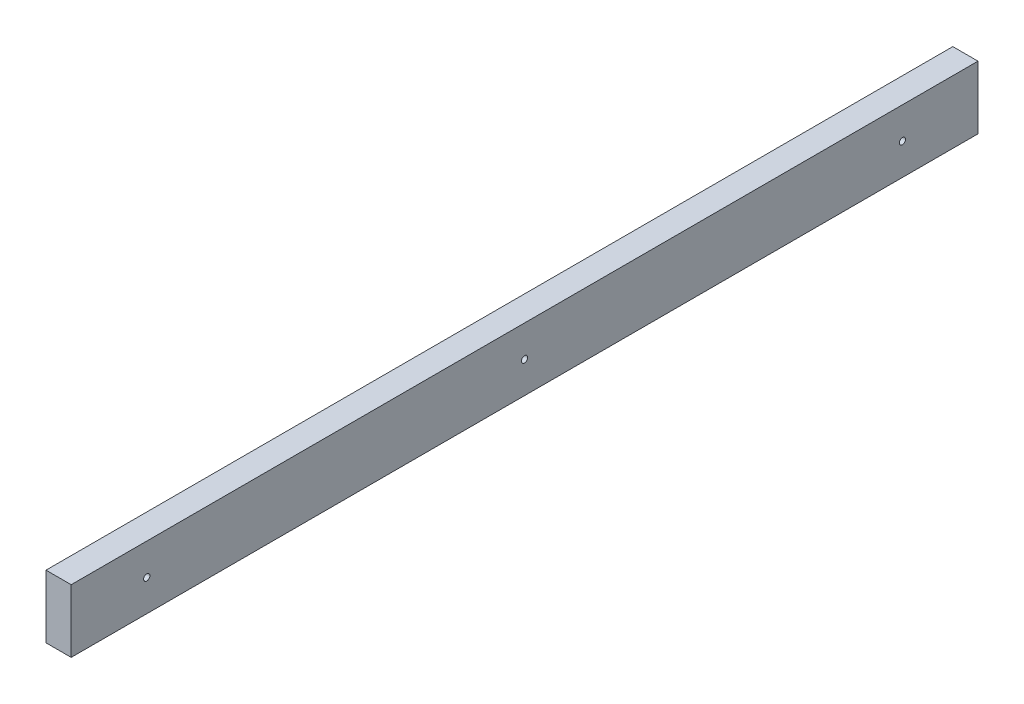
ISO-10303-21;
HEADER;
FILE_DESCRIPTION(('STEP AP214'),'2;1');
FILE_NAME('part.step','',(''),(''),'','','');
FILE_SCHEMA(('AUTOMOTIVE_DESIGN { 1 0 10303 214 1 1 1 1 }'));
ENDSEC;
DATA;
#1=APPLICATION_CONTEXT('core data for automotive mechanical design processes');
#2=APPLICATION_PROTOCOL_DEFINITION('international standard','automotive_design',2000,#1);
#3=PRODUCT_CONTEXT('',#1,'mechanical');
#4=PRODUCT('Part','Part','',(#3));
#5=PRODUCT_RELATED_PRODUCT_CATEGORY('part','',(#4));
#6=PRODUCT_DEFINITION_FORMATION('','',#4);
#7=PRODUCT_DEFINITION_CONTEXT('part definition',#1,'design');
#8=PRODUCT_DEFINITION('design','',#6,#7);
#9=PRODUCT_DEFINITION_SHAPE('','',#8);
#10=(LENGTH_UNIT() NAMED_UNIT(*) SI_UNIT(.MILLI.,.METRE.));
#11=(NAMED_UNIT(*) PLANE_ANGLE_UNIT() SI_UNIT($,.RADIAN.));
#12=(NAMED_UNIT(*) SI_UNIT($,.STERADIAN.) SOLID_ANGLE_UNIT());
#13=UNCERTAINTY_MEASURE_WITH_UNIT(LENGTH_MEASURE(1.E-05),#10,'distance_accuracy_value','');
#14=(GEOMETRIC_REPRESENTATION_CONTEXT(3) GLOBAL_UNCERTAINTY_ASSIGNED_CONTEXT((#13)) GLOBAL_UNIT_ASSIGNED_CONTEXT((#10,
#11,#12)) REPRESENTATION_CONTEXT('',''));
#15=CARTESIAN_POINT('',(0.,0.,0.));
#16=DIRECTION('',(0.,0.,1.));
#17=DIRECTION('',(1.,0.,0.));
#18=AXIS2_PLACEMENT_3D('',#15,#16,#17);
#19=CARTESIAN_POINT('',(12.7,0.,228.6));
#20=DIRECTION('',(0.,-1.,0.));
#21=DIRECTION('',(0.,0.,-1.));
#22=AXIS2_PLACEMENT_3D('',#19,#20,#21);
#23=PLANE('',#22);
#24=DIRECTION('',(-1.,0.,0.));
#25=VECTOR('',#24,1.);
#26=CARTESIAN_POINT('',(12.7,0.,-228.6));
#27=LINE('',#26,#25);
#28=CARTESIAN_POINT('',(12.7,0.,-228.6));
#29=VERTEX_POINT('',#28);
#30=CARTESIAN_POINT('',(0.,0.,-228.6));
#31=VERTEX_POINT('',#30);
#32=EDGE_CURVE('E94',#29,#31,#27,.T.);
#33=ORIENTED_EDGE('',*,*,#32,.T.);
#34=DIRECTION('',(0.,0.,-1.));
#35=VECTOR('',#34,1.);
#36=CARTESIAN_POINT('',(0.,0.,228.6));
#37=LINE('',#36,#35);
#38=CARTESIAN_POINT('',(0.,0.,228.6));
#39=VERTEX_POINT('',#38);
#40=EDGE_CURVE('E11',#39,#31,#37,.T.);
#41=ORIENTED_EDGE('',*,*,#40,.F.);
#42=DIRECTION('',(-1.,0.,0.));
#43=VECTOR('',#42,1.);
#44=CARTESIAN_POINT('',(12.7,0.,228.6));
#45=LINE('',#44,#43);
#46=CARTESIAN_POINT('',(12.7,0.,228.6));
#47=VERTEX_POINT('',#46);
#48=EDGE_CURVE('E82',#47,#39,#45,.T.);
#49=ORIENTED_EDGE('',*,*,#48,.F.);
#50=DIRECTION('',(0.,0.,-1.));
#51=VECTOR('',#50,1.);
#52=CARTESIAN_POINT('',(12.7,0.,228.6));
#53=LINE('',#52,#51);
#54=EDGE_CURVE('E90',#47,#29,#53,.T.);
#55=ORIENTED_EDGE('',*,*,#54,.T.);
#56=EDGE_LOOP('',(#33,#41,#49,#55));
#57=FACE_BOUND('',#56,.T.);
#58=ADVANCED_FACE('F31',(#57),#23,.F.);
#59=CARTESIAN_POINT('',(0.,0.,228.6));
#60=DIRECTION('',(1.,0.,0.));
#61=DIRECTION('',(0.,1.,0.));
#62=AXIS2_PLACEMENT_3D('',#59,#60,#61);
#63=PLANE('',#62);
#64=CARTESIAN_POINT('',(0.,-15.875,0.));
#65=DIRECTION('',(1.,0.,0.));
#66=DIRECTION('',(0.,1.,0.));
#67=AXIS2_PLACEMENT_3D('',#64,#65,#66);
#68=CIRCLE('',#67,1.5875);
#69=CARTESIAN_POINT('',(0.,-14.2875,0.));
#70=VERTEX_POINT('',#69);
#71=EDGE_CURVE('E119',#70,#70,#68,.F.);
#72=ORIENTED_EDGE('',*,*,#71,.F.);
#73=EDGE_LOOP('',(#72));
#74=FACE_BOUND('',#73,.T.);
#75=CARTESIAN_POINT('',(0.,-15.875,-190.5));
#76=DIRECTION('',(1.,0.,0.));
#77=DIRECTION('',(0.,1.,0.));
#78=AXIS2_PLACEMENT_3D('',#75,#76,#77);
#79=CIRCLE('',#78,1.58749999999999);
#80=CARTESIAN_POINT('',(0.,-14.2875,-190.5));
#81=VERTEX_POINT('',#80);
#82=EDGE_CURVE('E113',#81,#81,#79,.F.);
#83=ORIENTED_EDGE('',*,*,#82,.F.);
#84=EDGE_LOOP('',(#83));
#85=FACE_BOUND('',#84,.T.);
#86=CARTESIAN_POINT('',(0.,-15.875,190.5));
#87=DIRECTION('',(1.,0.,0.));
#88=DIRECTION('',(0.,1.,0.));
#89=AXIS2_PLACEMENT_3D('',#86,#87,#88);
#90=CIRCLE('',#89,1.58749999999999);
#91=CARTESIAN_POINT('',(0.,-14.2875,190.5));
#92=VERTEX_POINT('',#91);
#93=EDGE_CURVE('E97',#92,#92,#90,.F.);
#94=ORIENTED_EDGE('',*,*,#93,.F.);
#95=EDGE_LOOP('',(#94));
#96=FACE_BOUND('',#95,.T.);
#97=DIRECTION('',(0.,-1.,0.));
#98=VECTOR('',#97,1.);
#99=CARTESIAN_POINT('',(0.,0.,-228.6));
#100=LINE('',#99,#98);
#101=CARTESIAN_POINT('',(0.,-31.75,-228.6));
#102=VERTEX_POINT('',#101);
#103=EDGE_CURVE('E86',#31,#102,#100,.T.);
#104=ORIENTED_EDGE('',*,*,#103,.T.);
#105=DIRECTION('',(0.,0.,-1.));
#106=VECTOR('',#105,1.);
#107=CARTESIAN_POINT('',(0.,-31.75,228.6));
#108=LINE('',#107,#106);
#109=CARTESIAN_POINT('',(0.,-31.75,228.6));
#110=VERTEX_POINT('',#109);
#111=EDGE_CURVE('E39',#110,#102,#108,.T.);
#112=ORIENTED_EDGE('',*,*,#111,.F.);
#113=DIRECTION('',(0.,-1.,0.));
#114=VECTOR('',#113,1.);
#115=CARTESIAN_POINT('',(0.,0.,228.6));
#116=LINE('',#115,#114);
#117=EDGE_CURVE('E77',#39,#110,#116,.T.);
#118=ORIENTED_EDGE('',*,*,#117,.F.);
#119=ORIENTED_EDGE('',*,*,#40,.T.);
#120=EDGE_LOOP('',(#104,#112,#118,#119));
#121=FACE_BOUND('',#120,.T.);
#122=ADVANCED_FACE('F85',(#74,#85,#96,#121),#63,.F.);
#123=CARTESIAN_POINT('',(0.,-31.75,228.6));
#124=DIRECTION('',(0.,1.,0.));
#125=DIRECTION('',(0.,0.,1.));
#126=AXIS2_PLACEMENT_3D('',#123,#124,#125);
#127=PLANE('',#126);
#128=DIRECTION('',(1.,0.,0.));
#129=VECTOR('',#128,1.);
#130=CARTESIAN_POINT('',(0.,-31.75,-228.6));
#131=LINE('',#130,#129);
#132=CARTESIAN_POINT('',(12.7,-31.75,-228.6));
#133=VERTEX_POINT('',#132);
#134=EDGE_CURVE('E64',#102,#133,#131,.T.);
#135=ORIENTED_EDGE('',*,*,#134,.T.);
#136=DIRECTION('',(0.,0.,-1.));
#137=VECTOR('',#136,1.);
#138=CARTESIAN_POINT('',(12.7,-31.75,228.6));
#139=LINE('',#138,#137);
#140=CARTESIAN_POINT('',(12.7,-31.75,228.6));
#141=VERTEX_POINT('',#140);
#142=EDGE_CURVE('E87',#141,#133,#139,.T.);
#143=ORIENTED_EDGE('',*,*,#142,.F.);
#144=DIRECTION('',(1.,0.,0.));
#145=VECTOR('',#144,1.);
#146=CARTESIAN_POINT('',(0.,-31.75,228.6));
#147=LINE('',#146,#145);
#148=EDGE_CURVE('E80',#110,#141,#147,.T.);
#149=ORIENTED_EDGE('',*,*,#148,.F.);
#150=ORIENTED_EDGE('',*,*,#111,.T.);
#151=EDGE_LOOP('',(#135,#143,#149,#150));
#152=FACE_BOUND('',#151,.T.);
#153=ADVANCED_FACE('F88',(#152),#127,.F.);
#154=CARTESIAN_POINT('',(12.7,-31.75,228.6));
#155=DIRECTION('',(-1.,0.,0.));
#156=DIRECTION('',(0.,0.,1.));
#157=AXIS2_PLACEMENT_3D('',#154,#155,#156);
#158=PLANE('',#157);
#159=CARTESIAN_POINT('',(12.7,-15.875,0.));
#160=DIRECTION('',(1.,0.,0.));
#161=DIRECTION('',(0.,0.,-1.));
#162=AXIS2_PLACEMENT_3D('',#159,#160,#161);
#163=CIRCLE('',#162,1.5875);
#164=CARTESIAN_POINT('',(12.7,-15.875,-1.5875));
#165=VERTEX_POINT('',#164);
#166=EDGE_CURVE('E122',#165,#165,#163,.T.);
#167=ORIENTED_EDGE('',*,*,#166,.F.);
#168=EDGE_LOOP('',(#167));
#169=FACE_BOUND('',#168,.T.);
#170=CARTESIAN_POINT('',(12.7,-15.875,-190.5));
#171=DIRECTION('',(1.,0.,0.));
#172=DIRECTION('',(0.,0.,-1.));
#173=AXIS2_PLACEMENT_3D('',#170,#171,#172);
#174=CIRCLE('',#173,1.58749999999999);
#175=CARTESIAN_POINT('',(12.7,-15.875,-192.0875));
#176=VERTEX_POINT('',#175);
#177=EDGE_CURVE('E116',#176,#176,#174,.T.);
#178=ORIENTED_EDGE('',*,*,#177,.F.);
#179=EDGE_LOOP('',(#178));
#180=FACE_BOUND('',#179,.T.);
#181=CARTESIAN_POINT('',(12.7,-15.875,190.5));
#182=DIRECTION('',(1.,0.,0.));
#183=DIRECTION('',(0.,0.,-1.));
#184=AXIS2_PLACEMENT_3D('',#181,#182,#183);
#185=CIRCLE('',#184,1.58749999999999);
#186=CARTESIAN_POINT('',(12.7,-15.875,188.9125));
#187=VERTEX_POINT('',#186);
#188=EDGE_CURVE('E110',#187,#187,#185,.T.);
#189=ORIENTED_EDGE('',*,*,#188,.F.);
#190=EDGE_LOOP('',(#189));
#191=FACE_BOUND('',#190,.T.);
#192=DIRECTION('',(0.,1.,0.));
#193=VECTOR('',#192,1.);
#194=CARTESIAN_POINT('',(12.7,-31.75,-228.6));
#195=LINE('',#194,#193);
#196=EDGE_CURVE('E70',#133,#29,#195,.T.);
#197=ORIENTED_EDGE('',*,*,#196,.T.);
#198=ORIENTED_EDGE('',*,*,#54,.F.);
#199=DIRECTION('',(0.,1.,0.));
#200=VECTOR('',#199,1.);
#201=CARTESIAN_POINT('',(12.7,-31.75,228.6));
#202=LINE('',#201,#200);
#203=EDGE_CURVE('E47',#141,#47,#202,.T.);
#204=ORIENTED_EDGE('',*,*,#203,.F.);
#205=ORIENTED_EDGE('',*,*,#142,.T.);
#206=EDGE_LOOP('',(#197,#198,#204,#205));
#207=FACE_BOUND('',#206,.T.);
#208=ADVANCED_FACE('F102',(#169,#180,#191,#207),#158,.F.);
#209=CARTESIAN_POINT('',(12.7,0.,228.6));
#210=DIRECTION('',(0.,0.,-1.));
#211=DIRECTION('',(-1.,0.,0.));
#212=AXIS2_PLACEMENT_3D('',#209,#210,#211);
#213=PLANE('',#212);
#214=ORIENTED_EDGE('',*,*,#48,.T.);
#215=ORIENTED_EDGE('',*,*,#117,.T.);
#216=ORIENTED_EDGE('',*,*,#148,.T.);
#217=ORIENTED_EDGE('',*,*,#203,.T.);
#218=EDGE_LOOP('',(#214,#215,#216,#217));
#219=FACE_BOUND('',#218,.T.);
#220=ADVANCED_FACE('F78',(#219),#213,.F.);
#221=CARTESIAN_POINT('',(12.7,0.,-228.6));
#222=DIRECTION('',(0.,0.,-1.));
#223=DIRECTION('',(-1.,0.,0.));
#224=AXIS2_PLACEMENT_3D('',#221,#222,#223);
#225=PLANE('',#224);
#226=ORIENTED_EDGE('',*,*,#32,.F.);
#227=ORIENTED_EDGE('',*,*,#196,.F.);
#228=ORIENTED_EDGE('',*,*,#134,.F.);
#229=ORIENTED_EDGE('',*,*,#103,.F.);
#230=EDGE_LOOP('',(#226,#227,#228,#229));
#231=FACE_BOUND('',#230,.T.);
#232=ADVANCED_FACE('F105',(#231),#225,.T.);
#233=CARTESIAN_POINT('',(-4.49012806053458,-15.875,190.5));
#234=DIRECTION('',(1.,0.,0.));
#235=DIRECTION('',(0.,0.,-1.));
#236=AXIS2_PLACEMENT_3D('',#233,#234,#235);
#237=CYLINDRICAL_SURFACE('',#236,1.58749999999999);
#238=ORIENTED_EDGE('',*,*,#93,.T.);
#239=EDGE_LOOP('',(#238));
#240=FACE_BOUND('',#239,.T.);
#241=ORIENTED_EDGE('',*,*,#188,.T.);
#242=EDGE_LOOP('',(#241));
#243=FACE_BOUND('',#242,.T.);
#244=ADVANCED_FACE('F135',(#240,#243),#237,.F.);
#245=CARTESIAN_POINT('',(-4.49012806053458,-15.875,-190.5));
#246=DIRECTION('',(1.,0.,0.));
#247=DIRECTION('',(0.,0.,-1.));
#248=AXIS2_PLACEMENT_3D('',#245,#246,#247);
#249=CYLINDRICAL_SURFACE('',#248,1.58749999999999);
#250=ORIENTED_EDGE('',*,*,#82,.T.);
#251=EDGE_LOOP('',(#250));
#252=FACE_BOUND('',#251,.T.);
#253=ORIENTED_EDGE('',*,*,#177,.T.);
#254=EDGE_LOOP('',(#253));
#255=FACE_BOUND('',#254,.T.);
#256=ADVANCED_FACE('F137',(#252,#255),#249,.F.);
#257=CARTESIAN_POINT('',(-4.49012806053458,-15.875,0.));
#258=DIRECTION('',(1.,0.,0.));
#259=DIRECTION('',(0.,0.,-1.));
#260=AXIS2_PLACEMENT_3D('',#257,#258,#259);
#261=CYLINDRICAL_SURFACE('',#260,1.5875);
#262=ORIENTED_EDGE('',*,*,#71,.T.);
#263=EDGE_LOOP('',(#262));
#264=FACE_BOUND('',#263,.T.);
#265=ORIENTED_EDGE('',*,*,#166,.T.);
#266=EDGE_LOOP('',(#265));
#267=FACE_BOUND('',#266,.T.);
#268=ADVANCED_FACE('F126',(#264,#267),#261,.F.);
#269=CLOSED_SHELL('',(#58,#122,#153,#208,#220,#232,#244,#256,#268));
#270=MANIFOLD_SOLID_BREP('B2',#269);
#271=ADVANCED_BREP_SHAPE_REPRESENTATION('',(#18,#270),#14);
#272=SHAPE_DEFINITION_REPRESENTATION(#9,#271);
ENDSEC;
END-ISO-10303-21;
